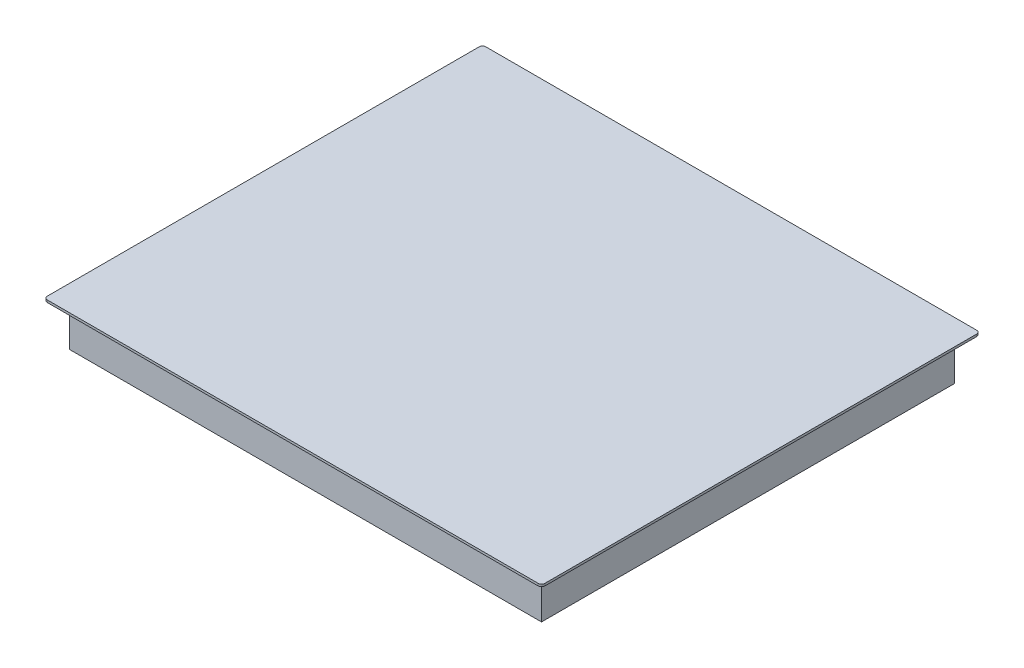
ISO-10303-21;
HEADER;
FILE_DESCRIPTION(('STEP AP214'),'2;1');
FILE_NAME('part.step','',(''),(''),'','','');
FILE_SCHEMA(('AUTOMOTIVE_DESIGN { 1 0 10303 214 1 1 1 1 }'));
ENDSEC;
DATA;
#1=APPLICATION_CONTEXT('core data for automotive mechanical design processes');
#2=APPLICATION_PROTOCOL_DEFINITION('international standard','automotive_design',2000,#1);
#3=PRODUCT_CONTEXT('',#1,'mechanical');
#4=PRODUCT('Part','Part','',(#3));
#5=PRODUCT_RELATED_PRODUCT_CATEGORY('part','',(#4));
#6=PRODUCT_DEFINITION_FORMATION('','',#4);
#7=PRODUCT_DEFINITION_CONTEXT('part definition',#1,'design');
#8=PRODUCT_DEFINITION('design','',#6,#7);
#9=PRODUCT_DEFINITION_SHAPE('','',#8);
#10=(LENGTH_UNIT() NAMED_UNIT(*) SI_UNIT(.MILLI.,.METRE.));
#11=(NAMED_UNIT(*) PLANE_ANGLE_UNIT() SI_UNIT($,.RADIAN.));
#12=(NAMED_UNIT(*) SI_UNIT($,.STERADIAN.) SOLID_ANGLE_UNIT());
#13=UNCERTAINTY_MEASURE_WITH_UNIT(LENGTH_MEASURE(1.E-05),#10,'distance_accuracy_value','');
#14=(GEOMETRIC_REPRESENTATION_CONTEXT(3) GLOBAL_UNCERTAINTY_ASSIGNED_CONTEXT((#13)) GLOBAL_UNIT_ASSIGNED_CONTEXT((#10,
#11,#12)) REPRESENTATION_CONTEXT('',''));
#15=CARTESIAN_POINT('',(0.,0.,0.));
#16=DIRECTION('',(0.,0.,1.));
#17=DIRECTION('',(1.,0.,0.));
#18=AXIS2_PLACEMENT_3D('',#15,#16,#17);
#19=CARTESIAN_POINT('',(0.,0.,0.));
#20=DIRECTION('',(0.,1.,0.));
#21=DIRECTION('',(0.,0.,1.));
#22=AXIS2_PLACEMENT_3D('',#19,#20,#21);
#23=PLANE('',#22);
#24=DIRECTION('',(0.,0.,1.));
#25=VECTOR('',#24,1.);
#26=CARTESIAN_POINT('',(-295.,0.,260.));
#27=LINE('',#26,#25);
#28=CARTESIAN_POINT('',(-295.,0.,-256.));
#29=VERTEX_POINT('',#28);
#30=CARTESIAN_POINT('',(-295.,0.,256.));
#31=VERTEX_POINT('',#30);
#32=EDGE_CURVE('E150',#29,#31,#27,.T.);
#33=ORIENTED_EDGE('',*,*,#32,.F.);
#34=CARTESIAN_POINT('',(-291.,0.,-256.));
#35=DIRECTION('',(0.,1.,0.));
#36=DIRECTION('',(0.,0.,1.));
#37=AXIS2_PLACEMENT_3D('',#34,#35,#36);
#38=CIRCLE('',#37,4.);
#39=CARTESIAN_POINT('',(-291.,0.,-260.));
#40=VERTEX_POINT('',#39);
#41=EDGE_CURVE('E187',#29,#40,#38,.F.);
#42=ORIENTED_EDGE('',*,*,#41,.T.);
#43=DIRECTION('',(-1.,0.,0.));
#44=VECTOR('',#43,1.);
#45=CARTESIAN_POINT('',(295.,0.,-260.));
#46=LINE('',#45,#44);
#47=CARTESIAN_POINT('',(291.,0.,-260.));
#48=VERTEX_POINT('',#47);
#49=EDGE_CURVE('E163',#48,#40,#46,.T.);
#50=ORIENTED_EDGE('',*,*,#49,.F.);
#51=CARTESIAN_POINT('',(291.,0.,-256.));
#52=DIRECTION('',(0.,1.,0.));
#53=DIRECTION('',(0.,0.,1.));
#54=AXIS2_PLACEMENT_3D('',#51,#52,#53);
#55=CIRCLE('',#54,4.);
#56=CARTESIAN_POINT('',(295.,0.,-256.));
#57=VERTEX_POINT('',#56);
#58=EDGE_CURVE('E185',#48,#57,#55,.F.);
#59=ORIENTED_EDGE('',*,*,#58,.T.);
#60=DIRECTION('',(0.,0.,-1.));
#61=VECTOR('',#60,1.);
#62=CARTESIAN_POINT('',(295.,0.,260.));
#63=LINE('',#62,#61);
#64=CARTESIAN_POINT('',(295.,0.,256.));
#65=VERTEX_POINT('',#64);
#66=EDGE_CURVE('E173',#65,#57,#63,.T.);
#67=ORIENTED_EDGE('',*,*,#66,.F.);
#68=CARTESIAN_POINT('',(291.,0.,256.));
#69=DIRECTION('',(0.,1.,0.));
#70=DIRECTION('',(0.,0.,1.));
#71=AXIS2_PLACEMENT_3D('',#68,#69,#70);
#72=CIRCLE('',#71,4.);
#73=CARTESIAN_POINT('',(291.,0.,260.));
#74=VERTEX_POINT('',#73);
#75=EDGE_CURVE('E183',#65,#74,#72,.F.);
#76=ORIENTED_EDGE('',*,*,#75,.T.);
#77=DIRECTION('',(1.,0.,0.));
#78=VECTOR('',#77,1.);
#79=CARTESIAN_POINT('',(295.,0.,260.));
#80=LINE('',#79,#78);
#81=CARTESIAN_POINT('',(-291.,0.,260.));
#82=VERTEX_POINT('',#81);
#83=EDGE_CURVE('E153',#82,#74,#80,.T.);
#84=ORIENTED_EDGE('',*,*,#83,.F.);
#85=CARTESIAN_POINT('',(-291.,0.,256.));
#86=DIRECTION('',(0.,1.,0.));
#87=DIRECTION('',(0.,0.,1.));
#88=AXIS2_PLACEMENT_3D('',#85,#86,#87);
#89=CIRCLE('',#88,4.);
#90=EDGE_CURVE('E181',#82,#31,#89,.F.);
#91=ORIENTED_EDGE('',*,*,#90,.T.);
#92=EDGE_LOOP('',(#33,#42,#50,#59,#67,#76,#84,#91));
#93=FACE_BOUND('',#92,.T.);
#94=DIRECTION('',(0.,0.,-1.));
#95=VECTOR('',#94,1.);
#96=CARTESIAN_POINT('',(-280.,0.,-245.));
#97=LINE('',#96,#95);
#98=CARTESIAN_POINT('',(-280.,0.,245.));
#99=VERTEX_POINT('',#98);
#100=CARTESIAN_POINT('',(-280.,0.,-245.));
#101=VERTEX_POINT('',#100);
#102=EDGE_CURVE('E149',#99,#101,#97,.T.);
#103=ORIENTED_EDGE('',*,*,#102,.F.);
#104=DIRECTION('',(-1.,0.,0.));
#105=VECTOR('',#104,1.);
#106=CARTESIAN_POINT('',(280.,0.,245.));
#107=LINE('',#106,#105);
#108=CARTESIAN_POINT('',(280.,0.,245.));
#109=VERTEX_POINT('',#108);
#110=EDGE_CURVE('E146',#109,#99,#107,.T.);
#111=ORIENTED_EDGE('',*,*,#110,.F.);
#112=DIRECTION('',(0.,0.,1.));
#113=VECTOR('',#112,1.);
#114=CARTESIAN_POINT('',(280.,0.,-245.));
#115=LINE('',#114,#113);
#116=CARTESIAN_POINT('',(280.,0.,-245.));
#117=VERTEX_POINT('',#116);
#118=EDGE_CURVE('E365',#117,#109,#115,.T.);
#119=ORIENTED_EDGE('',*,*,#118,.F.);
#120=DIRECTION('',(1.,0.,0.));
#121=VECTOR('',#120,1.);
#122=CARTESIAN_POINT('',(280.,0.,-245.));
#123=LINE('',#122,#121);
#124=EDGE_CURVE('E367',#101,#117,#123,.T.);
#125=ORIENTED_EDGE('',*,*,#124,.F.);
#126=EDGE_LOOP('',(#103,#111,#119,#125));
#127=FACE_BOUND('',#126,.T.);
#128=ADVANCED_FACE('F35',(#93,#127),#23,.F.);
#129=CARTESIAN_POINT('',(-295.,2.7,260.));
#130=DIRECTION('',(1.,0.,0.));
#131=DIRECTION('',(0.,0.,-1.));
#132=AXIS2_PLACEMENT_3D('',#129,#130,#131);
#133=PLANE('',#132);
#134=DIRECTION('',(0.,0.,1.));
#135=VECTOR('',#134,1.);
#136=CARTESIAN_POINT('',(-295.,2.7,260.));
#137=LINE('',#136,#135);
#138=CARTESIAN_POINT('',(-295.,2.7,-256.));
#139=VERTEX_POINT('',#138);
#140=CARTESIAN_POINT('',(-295.,2.7,256.));
#141=VERTEX_POINT('',#140);
#142=EDGE_CURVE('E159',#139,#141,#137,.T.);
#143=ORIENTED_EDGE('',*,*,#142,.F.);
#144=DIRECTION('',(0.,-1.,0.));
#145=VECTOR('',#144,1.);
#146=CARTESIAN_POINT('',(-295.,2.7,-256.));
#147=LINE('',#146,#145);
#148=EDGE_CURVE('E178',#139,#29,#147,.T.);
#149=ORIENTED_EDGE('',*,*,#148,.T.);
#150=ORIENTED_EDGE('',*,*,#32,.T.);
#151=DIRECTION('',(0.,-1.,0.));
#152=VECTOR('',#151,1.);
#153=CARTESIAN_POINT('',(-295.,2.7,256.));
#154=LINE('',#153,#152);
#155=EDGE_CURVE('E169',#31,#141,#154,.F.);
#156=ORIENTED_EDGE('',*,*,#155,.T.);
#157=EDGE_LOOP('',(#143,#149,#150,#156));
#158=FACE_BOUND('',#157,.T.);
#159=ADVANCED_FACE('F237',(#158),#133,.F.);
#160=CARTESIAN_POINT('',(295.,2.7,260.));
#161=DIRECTION('',(0.,0.,-1.));
#162=DIRECTION('',(-1.,0.,0.));
#163=AXIS2_PLACEMENT_3D('',#160,#161,#162);
#164=PLANE('',#163);
#165=ORIENTED_EDGE('',*,*,#83,.T.);
#166=DIRECTION('',(0.,-1.,0.));
#167=VECTOR('',#166,1.);
#168=CARTESIAN_POINT('',(291.,2.7,260.));
#169=LINE('',#168,#167);
#170=CARTESIAN_POINT('',(291.,2.7,260.));
#171=VERTEX_POINT('',#170);
#172=EDGE_CURVE('E11',#74,#171,#169,.F.);
#173=ORIENTED_EDGE('',*,*,#172,.T.);
#174=DIRECTION('',(1.,0.,0.));
#175=VECTOR('',#174,1.);
#176=CARTESIAN_POINT('',(295.,2.7,260.));
#177=LINE('',#176,#175);
#178=CARTESIAN_POINT('',(-291.,2.7,260.));
#179=VERTEX_POINT('',#178);
#180=EDGE_CURVE('E162',#179,#171,#177,.T.);
#181=ORIENTED_EDGE('',*,*,#180,.F.);
#182=DIRECTION('',(0.,-1.,0.));
#183=VECTOR('',#182,1.);
#184=CARTESIAN_POINT('',(-291.,2.7,260.));
#185=LINE('',#184,#183);
#186=EDGE_CURVE('E43',#179,#82,#185,.T.);
#187=ORIENTED_EDGE('',*,*,#186,.T.);
#188=EDGE_LOOP('',(#165,#173,#181,#187));
#189=FACE_BOUND('',#188,.T.);
#190=ADVANCED_FACE('F209',(#189),#164,.F.);
#191=CARTESIAN_POINT('',(295.,2.7,260.));
#192=DIRECTION('',(-1.,0.,0.));
#193=DIRECTION('',(0.,0.,1.));
#194=AXIS2_PLACEMENT_3D('',#191,#192,#193);
#195=PLANE('',#194);
#196=ORIENTED_EDGE('',*,*,#66,.T.);
#197=DIRECTION('',(0.,-1.,0.));
#198=VECTOR('',#197,1.);
#199=CARTESIAN_POINT('',(295.,2.7,-256.));
#200=LINE('',#199,#198);
#201=CARTESIAN_POINT('',(295.,2.7,-256.));
#202=VERTEX_POINT('',#201);
#203=EDGE_CURVE('E50',#57,#202,#200,.F.);
#204=ORIENTED_EDGE('',*,*,#203,.T.);
#205=DIRECTION('',(0.,0.,-1.));
#206=VECTOR('',#205,1.);
#207=CARTESIAN_POINT('',(295.,2.7,260.));
#208=LINE('',#207,#206);
#209=CARTESIAN_POINT('',(295.,2.7,256.));
#210=VERTEX_POINT('',#209);
#211=EDGE_CURVE('E165',#210,#202,#208,.T.);
#212=ORIENTED_EDGE('',*,*,#211,.F.);
#213=DIRECTION('',(0.,-1.,0.));
#214=VECTOR('',#213,1.);
#215=CARTESIAN_POINT('',(295.,2.7,256.));
#216=LINE('',#215,#214);
#217=EDGE_CURVE('E201',#210,#65,#216,.T.);
#218=ORIENTED_EDGE('',*,*,#217,.T.);
#219=EDGE_LOOP('',(#196,#204,#212,#218));
#220=FACE_BOUND('',#219,.T.);
#221=ADVANCED_FACE('F220',(#220),#195,.F.);
#222=CARTESIAN_POINT('',(295.,2.7,-260.));
#223=DIRECTION('',(0.,0.,1.));
#224=DIRECTION('',(1.,0.,0.));
#225=AXIS2_PLACEMENT_3D('',#222,#223,#224);
#226=PLANE('',#225);
#227=ORIENTED_EDGE('',*,*,#49,.T.);
#228=DIRECTION('',(0.,-1.,0.));
#229=VECTOR('',#228,1.);
#230=CARTESIAN_POINT('',(-291.,2.7,-260.));
#231=LINE('',#230,#229);
#232=CARTESIAN_POINT('',(-291.,2.7,-260.));
#233=VERTEX_POINT('',#232);
#234=EDGE_CURVE('E192',#40,#233,#231,.F.);
#235=ORIENTED_EDGE('',*,*,#234,.T.);
#236=DIRECTION('',(-1.,0.,0.));
#237=VECTOR('',#236,1.);
#238=CARTESIAN_POINT('',(295.,2.7,-260.));
#239=LINE('',#238,#237);
#240=CARTESIAN_POINT('',(291.,2.7,-260.));
#241=VERTEX_POINT('',#240);
#242=EDGE_CURVE('E167',#241,#233,#239,.T.);
#243=ORIENTED_EDGE('',*,*,#242,.F.);
#244=DIRECTION('',(0.,-1.,0.));
#245=VECTOR('',#244,1.);
#246=CARTESIAN_POINT('',(291.,2.7,-260.));
#247=LINE('',#246,#245);
#248=EDGE_CURVE('E189',#241,#48,#247,.T.);
#249=ORIENTED_EDGE('',*,*,#248,.T.);
#250=EDGE_LOOP('',(#227,#235,#243,#249));
#251=FACE_BOUND('',#250,.T.);
#252=ADVANCED_FACE('F229',(#251),#226,.F.);
#253=CARTESIAN_POINT('',(0.,2.7,0.));
#254=DIRECTION('',(0.,1.,0.));
#255=DIRECTION('',(0.,0.,1.));
#256=AXIS2_PLACEMENT_3D('',#253,#254,#255);
#257=PLANE('',#256);
#258=ORIENTED_EDGE('',*,*,#242,.T.);
#259=CARTESIAN_POINT('',(-291.,2.7,-256.));
#260=DIRECTION('',(0.,1.,0.));
#261=DIRECTION('',(0.,0.,1.));
#262=AXIS2_PLACEMENT_3D('',#259,#260,#261);
#263=CIRCLE('',#262,4.);
#264=EDGE_CURVE('E199',#233,#139,#263,.T.);
#265=ORIENTED_EDGE('',*,*,#264,.T.);
#266=ORIENTED_EDGE('',*,*,#142,.T.);
#267=CARTESIAN_POINT('',(-291.,2.7,256.));
#268=DIRECTION('',(0.,1.,0.));
#269=DIRECTION('',(0.,0.,1.));
#270=AXIS2_PLACEMENT_3D('',#267,#268,#269);
#271=CIRCLE('',#270,4.);
#272=EDGE_CURVE('E194',#141,#179,#271,.T.);
#273=ORIENTED_EDGE('',*,*,#272,.T.);
#274=ORIENTED_EDGE('',*,*,#180,.T.);
#275=CARTESIAN_POINT('',(291.,2.7,256.));
#276=DIRECTION('',(0.,1.,0.));
#277=DIRECTION('',(0.,0.,1.));
#278=AXIS2_PLACEMENT_3D('',#275,#276,#277);
#279=CIRCLE('',#278,4.);
#280=EDGE_CURVE('E57',#171,#210,#279,.T.);
#281=ORIENTED_EDGE('',*,*,#280,.T.);
#282=ORIENTED_EDGE('',*,*,#211,.T.);
#283=CARTESIAN_POINT('',(291.,2.7,-256.));
#284=DIRECTION('',(0.,1.,0.));
#285=DIRECTION('',(0.,0.,1.));
#286=AXIS2_PLACEMENT_3D('',#283,#284,#285);
#287=CIRCLE('',#286,4.);
#288=EDGE_CURVE('E197',#202,#241,#287,.T.);
#289=ORIENTED_EDGE('',*,*,#288,.T.);
#290=EDGE_LOOP('',(#258,#265,#266,#273,#274,#281,#282,#289));
#291=FACE_BOUND('',#290,.T.);
#292=ADVANCED_FACE('F222',(#291),#257,.T.);
#293=CARTESIAN_POINT('',(-280.,-50.,-245.));
#294=DIRECTION('',(1.,0.,0.));
#295=DIRECTION('',(0.,0.,-1.));
#296=AXIS2_PLACEMENT_3D('',#293,#294,#295);
#297=PLANE('',#296);
#298=ORIENTED_EDGE('',*,*,#102,.T.);
#299=DIRECTION('',(0.,1.,0.));
#300=VECTOR('',#299,1.);
#301=CARTESIAN_POINT('',(-280.,-50.,-245.));
#302=LINE('',#301,#300);
#303=CARTESIAN_POINT('',(-280.,-50.,-245.));
#304=VERTEX_POINT('',#303);
#305=EDGE_CURVE('E130',#304,#101,#302,.T.);
#306=ORIENTED_EDGE('',*,*,#305,.F.);
#307=DIRECTION('',(0.,0.,-1.));
#308=VECTOR('',#307,1.);
#309=CARTESIAN_POINT('',(-280.,-50.,-245.));
#310=LINE('',#309,#308);
#311=CARTESIAN_POINT('',(-280.,-50.,245.));
#312=VERTEX_POINT('',#311);
#313=EDGE_CURVE('E137',#312,#304,#310,.T.);
#314=ORIENTED_EDGE('',*,*,#313,.F.);
#315=DIRECTION('',(0.,1.,0.));
#316=VECTOR('',#315,1.);
#317=CARTESIAN_POINT('',(-280.,-50.,245.));
#318=LINE('',#317,#316);
#319=EDGE_CURVE('E370',#312,#99,#318,.T.);
#320=ORIENTED_EDGE('',*,*,#319,.T.);
#321=EDGE_LOOP('',(#298,#306,#314,#320));
#322=FACE_BOUND('',#321,.T.);
#323=ADVANCED_FACE('F148',(#322),#297,.F.);
#324=CARTESIAN_POINT('',(280.,-50.,-245.));
#325=DIRECTION('',(0.,0.,1.));
#326=DIRECTION('',(1.,0.,0.));
#327=AXIS2_PLACEMENT_3D('',#324,#325,#326);
#328=PLANE('',#327);
#329=ORIENTED_EDGE('',*,*,#124,.T.);
#330=DIRECTION('',(0.,1.,0.));
#331=VECTOR('',#330,1.);
#332=CARTESIAN_POINT('',(280.,-50.,-245.));
#333=LINE('',#332,#331);
#334=CARTESIAN_POINT('',(280.,-50.,-245.));
#335=VERTEX_POINT('',#334);
#336=EDGE_CURVE('E133',#335,#117,#333,.T.);
#337=ORIENTED_EDGE('',*,*,#336,.F.);
#338=DIRECTION('',(1.,0.,0.));
#339=VECTOR('',#338,1.);
#340=CARTESIAN_POINT('',(280.,-50.,-245.));
#341=LINE('',#340,#339);
#342=EDGE_CURVE('E125',#304,#335,#341,.T.);
#343=ORIENTED_EDGE('',*,*,#342,.F.);
#344=ORIENTED_EDGE('',*,*,#305,.T.);
#345=EDGE_LOOP('',(#329,#337,#343,#344));
#346=FACE_BOUND('',#345,.T.);
#347=ADVANCED_FACE('F128',(#346),#328,.F.);
#348=CARTESIAN_POINT('',(280.,-50.,-245.));
#349=DIRECTION('',(-1.,0.,0.));
#350=DIRECTION('',(0.,0.,1.));
#351=AXIS2_PLACEMENT_3D('',#348,#349,#350);
#352=PLANE('',#351);
#353=ORIENTED_EDGE('',*,*,#118,.T.);
#354=DIRECTION('',(0.,1.,0.));
#355=VECTOR('',#354,1.);
#356=CARTESIAN_POINT('',(280.,-50.,245.));
#357=LINE('',#356,#355);
#358=CARTESIAN_POINT('',(280.,-50.,245.));
#359=VERTEX_POINT('',#358);
#360=EDGE_CURVE('E155',#359,#109,#357,.T.);
#361=ORIENTED_EDGE('',*,*,#360,.F.);
#362=DIRECTION('',(0.,0.,1.));
#363=VECTOR('',#362,1.);
#364=CARTESIAN_POINT('',(280.,-50.,-245.));
#365=LINE('',#364,#363);
#366=EDGE_CURVE('E136',#335,#359,#365,.T.);
#367=ORIENTED_EDGE('',*,*,#366,.F.);
#368=ORIENTED_EDGE('',*,*,#336,.T.);
#369=EDGE_LOOP('',(#353,#361,#367,#368));
#370=FACE_BOUND('',#369,.T.);
#371=ADVANCED_FACE('F298',(#370),#352,.F.);
#372=CARTESIAN_POINT('',(280.,-50.,245.));
#373=DIRECTION('',(0.,0.,-1.));
#374=DIRECTION('',(-1.,0.,0.));
#375=AXIS2_PLACEMENT_3D('',#372,#373,#374);
#376=PLANE('',#375);
#377=ORIENTED_EDGE('',*,*,#110,.T.);
#378=ORIENTED_EDGE('',*,*,#319,.F.);
#379=DIRECTION('',(-1.,0.,0.));
#380=VECTOR('',#379,1.);
#381=CARTESIAN_POINT('',(280.,-50.,245.));
#382=LINE('',#381,#380);
#383=EDGE_CURVE('E142',#359,#312,#382,.T.);
#384=ORIENTED_EDGE('',*,*,#383,.F.);
#385=ORIENTED_EDGE('',*,*,#360,.T.);
#386=EDGE_LOOP('',(#377,#378,#384,#385));
#387=FACE_BOUND('',#386,.T.);
#388=ADVANCED_FACE('F290',(#387),#376,.F.);
#389=CARTESIAN_POINT('',(0.,-50.,0.));
#390=DIRECTION('',(0.,-1.,0.));
#391=DIRECTION('',(0.,0.,-1.));
#392=AXIS2_PLACEMENT_3D('',#389,#390,#391);
#393=PLANE('',#392);
#394=ORIENTED_EDGE('',*,*,#313,.T.);
#395=ORIENTED_EDGE('',*,*,#342,.T.);
#396=ORIENTED_EDGE('',*,*,#366,.T.);
#397=ORIENTED_EDGE('',*,*,#383,.T.);
#398=EDGE_LOOP('',(#394,#395,#396,#397));
#399=FACE_BOUND('',#398,.T.);
#400=ADVANCED_FACE('F140',(#399),#393,.T.);
#401=CARTESIAN_POINT('',(-291.,2.7,-256.));
#402=DIRECTION('',(0.,-1.,0.));
#403=DIRECTION('',(0.,0.,-1.));
#404=AXIS2_PLACEMENT_3D('',#401,#402,#403);
#405=CYLINDRICAL_SURFACE('',#404,4.);
#406=ORIENTED_EDGE('',*,*,#264,.F.);
#407=ORIENTED_EDGE('',*,*,#234,.F.);
#408=ORIENTED_EDGE('',*,*,#41,.F.);
#409=ORIENTED_EDGE('',*,*,#148,.F.);
#410=EDGE_LOOP('',(#406,#407,#408,#409));
#411=FACE_BOUND('',#410,.T.);
#412=ADVANCED_FACE('F234',(#411),#405,.T.);
#413=CARTESIAN_POINT('',(291.,2.7,-256.));
#414=DIRECTION('',(0.,-1.,0.));
#415=DIRECTION('',(0.,0.,-1.));
#416=AXIS2_PLACEMENT_3D('',#413,#414,#415);
#417=CYLINDRICAL_SURFACE('',#416,4.);
#418=ORIENTED_EDGE('',*,*,#288,.F.);
#419=ORIENTED_EDGE('',*,*,#203,.F.);
#420=ORIENTED_EDGE('',*,*,#58,.F.);
#421=ORIENTED_EDGE('',*,*,#248,.F.);
#422=EDGE_LOOP('',(#418,#419,#420,#421));
#423=FACE_BOUND('',#422,.T.);
#424=ADVANCED_FACE('F226',(#423),#417,.T.);
#425=CARTESIAN_POINT('',(291.,2.7,256.));
#426=DIRECTION('',(0.,-1.,0.));
#427=DIRECTION('',(0.,0.,-1.));
#428=AXIS2_PLACEMENT_3D('',#425,#426,#427);
#429=CYLINDRICAL_SURFACE('',#428,4.);
#430=ORIENTED_EDGE('',*,*,#280,.F.);
#431=ORIENTED_EDGE('',*,*,#172,.F.);
#432=ORIENTED_EDGE('',*,*,#75,.F.);
#433=ORIENTED_EDGE('',*,*,#217,.F.);
#434=EDGE_LOOP('',(#430,#431,#432,#433));
#435=FACE_BOUND('',#434,.T.);
#436=ADVANCED_FACE('F219',(#435),#429,.T.);
#437=CARTESIAN_POINT('',(-291.,2.7,256.));
#438=DIRECTION('',(0.,-1.,0.));
#439=DIRECTION('',(0.,0.,-1.));
#440=AXIS2_PLACEMENT_3D('',#437,#438,#439);
#441=CYLINDRICAL_SURFACE('',#440,4.);
#442=ORIENTED_EDGE('',*,*,#272,.F.);
#443=ORIENTED_EDGE('',*,*,#155,.F.);
#444=ORIENTED_EDGE('',*,*,#90,.F.);
#445=ORIENTED_EDGE('',*,*,#186,.F.);
#446=EDGE_LOOP('',(#442,#443,#444,#445));
#447=FACE_BOUND('',#446,.T.);
#448=ADVANCED_FACE('F37',(#447),#441,.T.);
#449=CLOSED_SHELL('',(#128,#159,#190,#221,#252,#292,#323,#347,#371,#388,#400,#412,#424,#436,#448));
#450=MANIFOLD_SOLID_BREP('B2',#449);
#451=ADVANCED_BREP_SHAPE_REPRESENTATION('',(#18,#450),#14);
#452=SHAPE_DEFINITION_REPRESENTATION(#9,#451);
ENDSEC;
END-ISO-10303-21;
